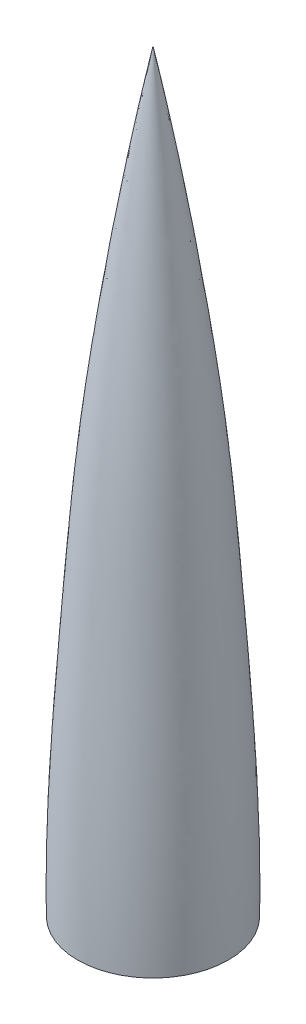
ISO-10303-21;
HEADER;
FILE_DESCRIPTION(('STEP AP214'),'2;1');
FILE_NAME('part.step','',(''),(''),'','','');
FILE_SCHEMA(('AUTOMOTIVE_DESIGN { 1 0 10303 214 1 1 1 1 }'));
ENDSEC;
DATA;
#1=APPLICATION_CONTEXT('core data for automotive mechanical design processes');
#2=APPLICATION_PROTOCOL_DEFINITION('international standard','automotive_design',2000,#1);
#3=PRODUCT_CONTEXT('',#1,'mechanical');
#4=PRODUCT('Part','Part','',(#3));
#5=PRODUCT_RELATED_PRODUCT_CATEGORY('part','',(#4));
#6=PRODUCT_DEFINITION_FORMATION('','',#4);
#7=PRODUCT_DEFINITION_CONTEXT('part definition',#1,'design');
#8=PRODUCT_DEFINITION('design','',#6,#7);
#9=PRODUCT_DEFINITION_SHAPE('','',#8);
#10=(LENGTH_UNIT() NAMED_UNIT(*) SI_UNIT(.MILLI.,.METRE.));
#11=(NAMED_UNIT(*) PLANE_ANGLE_UNIT() SI_UNIT($,.RADIAN.));
#12=(NAMED_UNIT(*) SI_UNIT($,.STERADIAN.) SOLID_ANGLE_UNIT());
#13=UNCERTAINTY_MEASURE_WITH_UNIT(LENGTH_MEASURE(1.E-05),#10,'distance_accuracy_value','');
#14=(GEOMETRIC_REPRESENTATION_CONTEXT(3) GLOBAL_UNCERTAINTY_ASSIGNED_CONTEXT((#13)) GLOBAL_UNIT_ASSIGNED_CONTEXT((#10,
#11,#12)) REPRESENTATION_CONTEXT('',''));
#15=CARTESIAN_POINT('',(0.,0.,0.));
#16=DIRECTION('',(0.,0.,1.));
#17=DIRECTION('',(1.,0.,0.));
#18=AXIS2_PLACEMENT_3D('',#15,#16,#17);
#19=CARTESIAN_POINT('',(0.,0.,0.));
#20=DIRECTION('',(0.,-1.,0.));
#21=DIRECTION('',(0.,0.,-1.));
#22=AXIS2_PLACEMENT_3D('',#19,#20,#21);
#23=CONICAL_SURFACE('',#22,51.1048,1.55506441211883);
#24=CARTESIAN_POINT('',(0.,0.,0.));
#25=DIRECTION('',(0.,1.,0.));
#26=DIRECTION('',(0.,0.,1.));
#27=AXIS2_PLACEMENT_3D('',#24,#25,#26);
#28=CIRCLE('',#27,51.1048);
#29=CARTESIAN_POINT('',(0.,0.,51.1048));
#30=VERTEX_POINT('',#29);
#31=EDGE_CURVE('E13',#30,#30,#28,.T.);
#32=ORIENTED_EDGE('',*,*,#31,.F.);
#33=EDGE_LOOP('',(#32));
#34=FACE_BOUND('',#33,.T.);
#35=CARTESIAN_POINT('',(0.,0.0247735973197888,0.));
#36=DIRECTION('',(0.,1.,0.));
#37=DIRECTION('',(1.,0.,0.));
#38=AXIS2_PLACEMENT_3D('',#35,#36,#37);
#39=CIRCLE('',#38,49.5301948720788);
#40=CARTESIAN_POINT('',(49.5301948720788,0.0247735973197888,0.));
#41=VERTEX_POINT('',#40);
#42=EDGE_CURVE('E59',#41,#41,#39,.T.);
#43=ORIENTED_EDGE('',*,*,#42,.T.);
#44=EDGE_LOOP('',(#43));
#45=FACE_BOUND('',#44,.T.);
#46=ADVANCED_FACE('F48',(#34,#45),#23,.F.);
#47=CARTESIAN_POINT('',(0.,511.048,0.));
#48=CARTESIAN_POINT('',(10.2875507396132,460.529083627564,0.));
#49=CARTESIAN_POINT('',(23.0284991196723,384.432798218235,0.));
#50=CARTESIAN_POINT('',(37.337951552627,274.199742857664,0.));
#51=CARTESIAN_POINT('',(45.7142467506298,154.538989731651,0.));
#52=CARTESIAN_POINT('',(52.055219106879,60.4084574415134,0.));
#53=CARTESIAN_POINT('',(51.1048,0.,0.));
#54=B_SPLINE_CURVE_WITH_KNOTS('',3,(#47,#48,#49,#50,#51,#52,#53),.UNSPECIFIED.,.F.,.F.,(4,1,1,1,
4),(0.,0.300603997005617,0.449898067349453,0.648058441452392,1.),.UNSPECIFIED.);
#55=CARTESIAN_POINT('',(0.,0.,0.));
#56=DIRECTION('',(0.,1.,0.));
#57=AXIS1_PLACEMENT('',#55,#56);
#58=SURFACE_OF_REVOLUTION('',#54,#57);
#59=ORIENTED_EDGE('',*,*,#31,.T.);
#60=EDGE_LOOP('',(#59));
#61=FACE_BOUND('',#60,.T.);
#62=CARTESIAN_POINT('',(0.,511.048,0.));
#63=VERTEX_POINT('',#62);
#64=VERTEX_LOOP('',#63);
#65=FACE_BOUND('',#64,.T.);
#66=ADVANCED_FACE('F68',(#61,#65),#58,.F.);
#67=CARTESIAN_POINT('',(1.54422163394072,503.39607442642,0.));
#68=CARTESIAN_POINT('',(11.1437033914222,455.396090841655,0.));
#69=CARTESIAN_POINT('',(23.3635098929732,381.852038311963,0.));
#70=CARTESIAN_POINT('',(37.337951552627,274.199742857664,0.));
#71=CARTESIAN_POINT('',(45.7142467506298,154.538989731651,0.));
#72=CARTESIAN_POINT('',(52.055219106879,60.4084574415134,0.));
#73=CARTESIAN_POINT('',(51.1048,0.,0.));
#74=B_SPLINE_CURVE_WITH_KNOTS('',3,(#67,#68,#69,#70,#71,#72,#73),.UNSPECIFIED.,.F.,.F.,(4,1,1,1,
4),(0.0151722478992404,0.300603997005617,0.449898067349453,0.648058441452392,1.),.UNSPECIFIED.);
#75=CARTESIAN_POINT('',(0.,0.,0.));
#76=DIRECTION('',(0.,1.,0.));
#77=AXIS1_PLACEMENT('',#75,#76);
#78=SURFACE_OF_REVOLUTION('',#74,#77);
#79=OFFSET_SURFACE('',#78,1.5748,.F.);
#80=CARTESIAN_POINT('',(0.,503.087246666545,0.));
#81=VERTEX_POINT('',#80);
#82=VERTEX_LOOP('',#81);
#83=FACE_BOUND('',#82,.T.);
#84=ORIENTED_EDGE('',*,*,#42,.F.);
#85=EDGE_LOOP('',(#84));
#86=FACE_BOUND('',#85,.T.);
#87=ADVANCED_FACE('F65',(#83,#86),#79,.T.);
#88=CLOSED_SHELL('',(#46,#66,#87));
#89=MANIFOLD_SOLID_BREP('B2',#88);
#90=ADVANCED_BREP_SHAPE_REPRESENTATION('',(#18,#89),#14);
#91=SHAPE_DEFINITION_REPRESENTATION(#9,#90);
ENDSEC;
END-ISO-10303-21;
